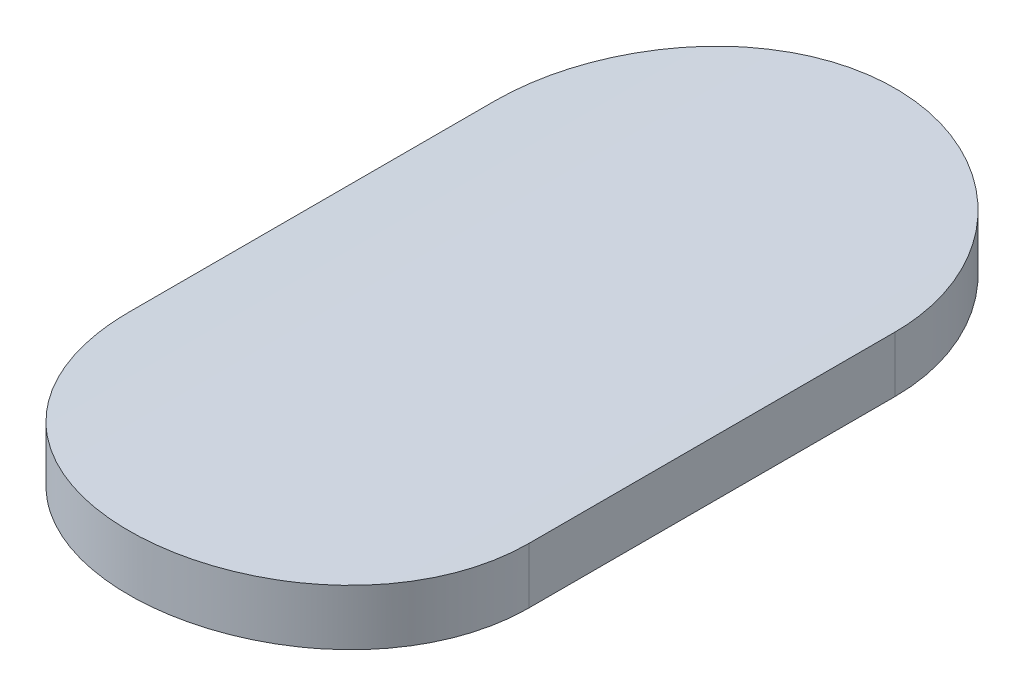
ISO-10303-21;
HEADER;
FILE_DESCRIPTION(('STEP AP214'),'2;1');
FILE_NAME('part.step','',(''),(''),'','','');
FILE_SCHEMA(('AUTOMOTIVE_DESIGN { 1 0 10303 214 1 1 1 1 }'));
ENDSEC;
DATA;
#1=APPLICATION_CONTEXT('core data for automotive mechanical design processes');
#2=APPLICATION_PROTOCOL_DEFINITION('international standard','automotive_design',2000,#1);
#3=PRODUCT_CONTEXT('',#1,'mechanical');
#4=PRODUCT('Part','Part','',(#3));
#5=PRODUCT_RELATED_PRODUCT_CATEGORY('part','',(#4));
#6=PRODUCT_DEFINITION_FORMATION('','',#4);
#7=PRODUCT_DEFINITION_CONTEXT('part definition',#1,'design');
#8=PRODUCT_DEFINITION('design','',#6,#7);
#9=PRODUCT_DEFINITION_SHAPE('','',#8);
#10=(LENGTH_UNIT() NAMED_UNIT(*) SI_UNIT(.MILLI.,.METRE.));
#11=(NAMED_UNIT(*) PLANE_ANGLE_UNIT() SI_UNIT($,.RADIAN.));
#12=(NAMED_UNIT(*) SI_UNIT($,.STERADIAN.) SOLID_ANGLE_UNIT());
#13=UNCERTAINTY_MEASURE_WITH_UNIT(LENGTH_MEASURE(1.E-05),#10,'distance_accuracy_value','');
#14=(GEOMETRIC_REPRESENTATION_CONTEXT(3) GLOBAL_UNCERTAINTY_ASSIGNED_CONTEXT((#13)) GLOBAL_UNIT_ASSIGNED_CONTEXT((#10,
#11,#12)) REPRESENTATION_CONTEXT('',''));
#15=CARTESIAN_POINT('',(0.,0.,0.));
#16=DIRECTION('',(0.,0.,1.));
#17=DIRECTION('',(1.,0.,0.));
#18=AXIS2_PLACEMENT_3D('',#15,#16,#17);
#19=CARTESIAN_POINT('',(-127.923352159799,-34.2539777719783,0.898559059800277));
#20=DIRECTION('',(0.,0.,1.));
#21=DIRECTION('',(1.,0.,0.));
#22=AXIS2_PLACEMENT_3D('',#19,#20,#21);
#23=CYLINDRICAL_SURFACE('',#22,4.);
#24=DIRECTION('',(0.,0.,1.));
#25=VECTOR('',#24,1.);
#26=CARTESIAN_POINT('',(-127.491108186985,-30.2774007077224,-0.678492229661472));
#27=LINE('',#26,#25);
#28=CARTESIAN_POINT('',(-127.491108186985,-30.2774007077224,-0.678492229661475));
#29=VERTEX_POINT('',#28);
#30=CARTESIAN_POINT('',(-127.491108186985,-30.2774007077224,-1.46918242298189));
#31=VERTEX_POINT('',#30);
#32=EDGE_CURVE('E72',#29,#31,#27,.F.);
#33=ORIENTED_EDGE('',*,*,#32,.T.);
#34=CARTESIAN_POINT('',(-128.355596132613,-30.2774007077224,-1.46918242298189));
#35=CARTESIAN_POINT('',(-128.355617122564,-30.2774093031019,-1.49342415054569));
#36=CARTESIAN_POINT('',(-128.353558088976,-30.2771792736355,-1.51765810390606));
#37=CARTESIAN_POINT('',(-128.34543664358,-30.2763057646066,-1.56541496661541));
#38=CARTESIAN_POINT('',(-128.339378115823,-30.275662686187,-1.58893854268275));
#39=CARTESIAN_POINT('',(-128.323410759997,-30.2740263383597,-1.6346374642423));
#40=CARTESIAN_POINT('',(-128.313500468394,-30.2730329358545,-1.65681229355003));
#41=CARTESIAN_POINT('',(-128.290122387864,-30.2708109602009,-1.69918125964866));
#42=CARTESIAN_POINT('',(-128.276655134346,-30.2695824224536,-1.71937569391019));
#43=CARTESIAN_POINT('',(-128.246485774422,-30.2670223239816,-1.75729478754694));
#44=CARTESIAN_POINT('',(-128.229772278111,-30.2656904107286,-1.77501036152479));
#45=CARTESIAN_POINT('',(-128.193602531438,-30.2630765062061,-1.80739683876146));
#46=CARTESIAN_POINT('',(-128.174145251963,-30.2617945338994,-1.8220665944957));
#47=CARTESIAN_POINT('',(-128.132979806713,-30.2594212030673,-1.8479758835284));
#48=CARTESIAN_POINT('',(-128.111265352569,-30.2583304011072,-1.85920546999589));
#49=CARTESIAN_POINT('',(-128.06626175851,-30.256468301793,-1.87784310001374));
#50=CARTESIAN_POINT('',(-128.042974493225,-30.2556966316195,-1.88525560529049));
#51=CARTESIAN_POINT('',(-128.003525585014,-30.2547502618519,-1.89423234228377));
#52=CARTESIAN_POINT('',(-127.98761455235,-30.2544619567996,-1.89692632382277));
#53=CARTESIAN_POINT('',(-127.955588715831,-30.2540756112707,-1.90052371061654));
#54=CARTESIAN_POINT('',(-127.939473908818,-30.2539775737453,-1.90142708809718));
#55=CARTESIAN_POINT('',(-127.899148198746,-30.2539780695901,-1.90142535642739));
#56=CARTESIAN_POINT('',(-127.874928590604,-30.2541997878823,-1.89938656879107));
#57=CARTESIAN_POINT('',(-127.827162093491,-30.2550629316294,-1.89128473995332));
#58=CARTESIAN_POINT('',(-127.803615946452,-30.2557048026716,-1.88521742625409));
#59=CARTESIAN_POINT('',(-127.75789437027,-30.2573358336208,-1.86923797188849));
#60=CARTESIAN_POINT('',(-127.735718096663,-30.2583247770098,-1.85932822788572));
#61=CARTESIAN_POINT('',(-127.693347746542,-30.260539573146,-1.83594976445063));
#62=CARTESIAN_POINT('',(-127.6731533329,-30.2617653854946,-1.82248165176367));
#63=CARTESIAN_POINT('',(-127.635232215171,-30.264322400245,-1.7923093292943));
#64=CARTESIAN_POINT('',(-127.617514873633,-30.2656539741725,-1.77559338359708));
#65=CARTESIAN_POINT('',(-127.585130542844,-30.2682694573901,-1.73942346959317));
#66=CARTESIAN_POINT('',(-127.570463816169,-30.2695533625694,-1.71996926583743));
#67=CARTESIAN_POINT('',(-127.544561149847,-30.2719321143963,-1.67881358279142));
#68=CARTESIAN_POINT('',(-127.533334696151,-30.2730264347539,-1.65710610696893));
#69=CARTESIAN_POINT('',(-127.514694899956,-30.2748965279095,-1.61210325687929));
#70=CARTESIAN_POINT('',(-127.507279455028,-30.275672476297,-1.58880876617574));
#71=CARTESIAN_POINT('',(-127.498299357738,-30.2766239966666,-1.54934191245782));
#72=CARTESIAN_POINT('',(-127.495604627655,-30.2769138194438,-1.53342024600917));
#73=CARTESIAN_POINT('',(-127.492009108139,-30.2773027678914,-1.50139550136583));
#74=CARTESIAN_POINT('',(-127.491105867911,-30.2774021540766,-1.48529270135609));
#75=CARTESIAN_POINT('',(-127.491108186985,-30.2774007077224,-1.46918242298189));
#76=B_SPLINE_CURVE_WITH_KNOTS('',3,(#34,#35,#36,#37,#38,#39,#40,#41,#42,#43,#44,#45,#46,#47,#48,
#49,#50,#51,#52,#53,#54,#55,#56,#57,#58,#59,#60,#61,#62,#63,#64,#65,#66,#67,#68,#69,#70,#71,#72,
#73,#74,#75),.UNSPECIFIED.,.F.,.F.,(4,2,2,2,2,2,2,2,2,2,2,2,2,2,2,2,2,2,2,2,4),(0.,
0.0726253836740618,0.145180341790964,0.217762895225312,0.29033452944683,0.363165547703872,
0.436023955754679,0.509091078909629,0.58207260007002,0.630397888655176,0.678723926810382,
0.751276944723526,0.823907032711242,0.896491891356269,0.969064381374195,1.04190415719805,
1.11475019997867,1.18779533226152,1.26080012417625,1.30915708875173,1.3574478542525),.UNSPECIFIED.);
#77=CARTESIAN_POINT('',(-128.355596132613,-30.2774007077224,-1.46918242298189));
#78=VERTEX_POINT('',#77);
#79=EDGE_CURVE('E21',#78,#31,#76,.T.);
#80=ORIENTED_EDGE('',*,*,#79,.F.);
#81=DIRECTION('',(0.,0.,1.));
#82=VECTOR('',#81,1.);
#83=CARTESIAN_POINT('',(-128.355596132613,-30.2774007077224,-1.46918242298189));
#84=LINE('',#83,#82);
#85=CARTESIAN_POINT('',(-128.355596132613,-30.2774007077224,-0.678492229661472));
#86=VERTEX_POINT('',#85);
#87=EDGE_CURVE('E59',#78,#86,#84,.T.);
#88=ORIENTED_EDGE('',*,*,#87,.T.);
#89=CARTESIAN_POINT('',(-127.491108186985,-30.2774007077224,-0.678492229661474));
#90=CARTESIAN_POINT('',(-127.491087200258,-30.2774093032284,-0.654250427458845));
#91=CARTESIAN_POINT('',(-127.493146244914,-30.2771792722828,-0.630016399645478));
#92=CARTESIAN_POINT('',(-127.501267711605,-30.2763057606253,-0.582259541124402));
#93=CARTESIAN_POINT('',(-127.507326225035,-30.2756626835922,-0.558736039480906));
#94=CARTESIAN_POINT('',(-127.523293392494,-30.2740263559012,-0.513037676301115));
#95=CARTESIAN_POINT('',(-127.533203439736,-30.2730329785416,-0.490863306145451));
#96=CARTESIAN_POINT('',(-127.556581342248,-30.2708110127296,-0.448494260139314));
#97=CARTESIAN_POINT('',(-127.570048813953,-30.269582449639,-0.428299371181569));
#98=CARTESIAN_POINT('',(-127.600220287064,-30.2670221805072,-0.390377730187715));
#99=CARTESIAN_POINT('',(-127.6169359698,-30.2656901129391,-0.372660295426246));
#100=CARTESIAN_POINT('',(-127.653105985133,-30.2630762167541,-0.340274534345393));
#101=CARTESIAN_POINT('',(-127.672560734073,-30.2617943958127,-0.325606672407616));
#102=CARTESIAN_POINT('',(-127.713713980875,-30.2594218523872,-0.299705735613899));
#103=CARTESIAN_POINT('',(-127.735417823731,-30.2583316025356,-0.288481106240474));
#104=CARTESIAN_POINT('',(-127.780414746846,-30.256469127083,-0.269839910920559));
#105=CARTESIAN_POINT('',(-127.803707686985,-30.2556968734842,-0.262423009712415));
#106=CARTESIAN_POINT('',(-127.851126252775,-30.2545598909362,-0.251634896140754));
#107=CARTESIAN_POINT('',(-127.875248269521,-30.2541935815582,-0.248247990307833));
#108=CARTESIAN_POINT('',(-127.923721524934,-30.2539043752213,-0.245567410692591));
#109=CARTESIAN_POINT('',(-127.948072762323,-30.2539814757901,-0.246273714087672));
#110=CARTESIAN_POINT('',(-127.996205292226,-30.2545691293883,-0.251746959967107));
#111=CARTESIAN_POINT('',(-128.019988542231,-30.2550778685343,-0.256496910034631));
#112=CARTESIAN_POINT('',(-128.066418176187,-30.2564695592699,-0.269896092472021));
#113=CARTESIAN_POINT('',(-128.089064549109,-30.2573525144896,-0.278545362667916));
#114=CARTESIAN_POINT('',(-128.132631413093,-30.2593965328097,-0.299516328549055));
#115=CARTESIAN_POINT('',(-128.153548245803,-30.2605581661113,-0.311845566586497));
#116=CARTESIAN_POINT('',(-128.193021297876,-30.2630292276311,-0.339820407305529));
#117=CARTESIAN_POINT('',(-128.211577539937,-30.2643386544279,-0.355465978094735));
#118=CARTESIAN_POINT('',(-128.245901026669,-30.266966287132,-0.38972256596268));
#119=CARTESIAN_POINT('',(-128.261653919007,-30.2682845042809,-0.408347965710109));
#120=CARTESIAN_POINT('',(-128.289816419944,-30.2707749518531,-0.447992642075992));
#121=CARTESIAN_POINT('',(-128.302225018855,-30.2719471381305,-0.469012638937776));
#122=CARTESIAN_POINT('',(-128.323347957904,-30.2740134538803,-0.51286780268918));
#123=CARTESIAN_POINT('',(-128.33205911907,-30.2749073439048,-0.535704511598378));
#124=CARTESIAN_POINT('',(-128.345502485206,-30.276310415507,-0.582500581006857));
#125=CARTESIAN_POINT('',(-128.350240700685,-30.276820178097,-0.606458187554224));
#126=CARTESIAN_POINT('',(-128.354711987777,-30.2773050457114,-0.646526456869655));
#127=CARTESIAN_POINT('',(-128.355603730248,-30.2774034970038,-0.662513193898366));
#128=CARTESIAN_POINT('',(-128.355596132613,-30.2774007077224,-0.678492229661471));
#129=B_SPLINE_CURVE_WITH_KNOTS('',3,(#89,#90,#91,#92,#93,#94,#95,#96,#97,#98,#99,#100,#101,#102,
#103,#104,#105,#106,#107,#108,#109,#110,#111,#112,#113,#114,#115,#116,#117,#118,#119,#120,#121,
#122,#123,#124,#125,#126,#127,#128),.UNSPECIFIED.,.F.,.F.,(4,2,2,2,2,2,2,2,2,2,2,2,2,2,2,2,2,2,
2,4),(0.,0.072625606291323,0.145180341787483,0.217761346895158,0.290334529464339,
0.363173700807065,0.436023955812664,0.509051493289564,0.582072599757541,0.654808409475985,
0.72754381364014,0.799975065682706,0.872407020372288,0.944988460927709,1.01756920351632,
1.09051146956909,1.1634757333035,1.23650260356937,1.30941879404999,1.35735159725356),.UNSPECIFIED.);
#130=EDGE_CURVE('E73',#29,#86,#129,.T.);
#131=ORIENTED_EDGE('',*,*,#130,.F.);
#132=EDGE_LOOP('',(#33,#80,#88,#131));
#133=FACE_BOUND('',#132,.T.);
#134=ADVANCED_FACE('F17',(#133),#23,.T.);
#135=CARTESIAN_POINT('',(-127.491108186985,-36.1825523620957,-0.678492229661472));
#136=DIRECTION('',(-1.,0.,0.));
#137=DIRECTION('',(0.,0.,1.));
#138=AXIS2_PLACEMENT_3D('',#135,#136,#137);
#139=PLANE('',#138);
#140=DIRECTION('',(0.,0.,1.));
#141=VECTOR('',#140,1.);
#142=CARTESIAN_POINT('',(-127.491108186985,-30.3981295970671,0.898559059800277));
#143=LINE('',#142,#141);
#144=CARTESIAN_POINT('',(-127.491108186985,-30.3981295970671,-0.678492229661472));
#145=VERTEX_POINT('',#144);
#146=CARTESIAN_POINT('',(-127.491108186985,-30.3981295970671,-1.46918242298189));
#147=VERTEX_POINT('',#146);
#148=EDGE_CURVE('E80',#145,#147,#143,.F.);
#149=ORIENTED_EDGE('',*,*,#148,.T.);
#150=DIRECTION('',(0.,-1.,0.));
#151=VECTOR('',#150,1.);
#152=CARTESIAN_POINT('',(-127.491108186985,-36.1825523620957,-1.46918242298189));
#153=LINE('',#152,#151);
#154=EDGE_CURVE('E67',#31,#147,#153,.T.);
#155=ORIENTED_EDGE('',*,*,#154,.F.);
#156=ORIENTED_EDGE('',*,*,#32,.F.);
#157=DIRECTION('',(0.,-1.,0.));
#158=VECTOR('',#157,1.);
#159=CARTESIAN_POINT('',(-127.491108186985,-36.1825523620957,-0.678492229661473));
#160=LINE('',#159,#158);
#161=EDGE_CURVE('E106',#145,#29,#160,.F.);
#162=ORIENTED_EDGE('',*,*,#161,.F.);
#163=EDGE_LOOP('',(#149,#155,#156,#162));
#164=FACE_BOUND('',#163,.T.);
#165=ADVANCED_FACE('F79',(#164),#139,.F.);
#166=CARTESIAN_POINT('',(-127.923352159799,-36.1825523620957,-1.46918242298189));
#167=DIRECTION('',(0.,-1.,0.));
#168=DIRECTION('',(0.,0.,-1.));
#169=AXIS2_PLACEMENT_3D('',#166,#167,#168);
#170=CYLINDRICAL_SURFACE('',#169,0.432243972813884);
#171=CARTESIAN_POINT('',(-127.491108186985,-30.3981295970671,-1.46918242298189));
#172=CARTESIAN_POINT('',(-127.491087176005,-30.3981384613911,-1.49341944056628));
#173=CARTESIAN_POINT('',(-127.493145434531,-30.3979013183327,-1.51764858241784));
#174=CARTESIAN_POINT('',(-127.50126353888,-30.3970008343414,-1.56539543040902));
#175=CARTESIAN_POINT('',(-127.507319440707,-30.3963379134897,-1.5889138138771));
#176=CARTESIAN_POINT('',(-127.523279427615,-30.3946511351842,-1.63460239824323));
#177=CARTESIAN_POINT('',(-127.533184950578,-30.3936271428788,-1.65677209180602));
#178=CARTESIAN_POINT('',(-127.556551387832,-30.3913367859818,-1.69913183460088));
#179=CARTESIAN_POINT('',(-127.570011787124,-30.390070456505,-1.7193221700041));
#180=CARTESIAN_POINT('',(-127.600169143537,-30.3874312779715,-1.75723922149469));
#181=CARTESIAN_POINT('',(-127.616878216478,-30.3860580420779,-1.77495627487206));
#182=CARTESIAN_POINT('',(-127.653039344167,-30.3833629484715,-1.80734680014699));
#183=CARTESIAN_POINT('',(-127.672492427153,-30.3820411102565,-1.822019126007));
#184=CARTESIAN_POINT('',(-127.713653639597,-30.3795936233061,-1.84793680148068));
#185=CARTESIAN_POINT('',(-127.735368406291,-30.3784685795403,-1.85917166054735));
#186=CARTESIAN_POINT('',(-127.780374427183,-30.3765478765735,-1.87781944664759));
#187=CARTESIAN_POINT('',(-127.803663803901,-30.3757518328769,-1.88523683757819));
#188=CARTESIAN_POINT('',(-127.843125385669,-30.3747752200699,-1.89422267943798));
#189=CARTESIAN_POINT('',(-127.859046755777,-30.3744776019595,-1.89692026775505));
#190=CARTESIAN_POINT('',(-127.891093821193,-30.3740787743024,-1.90052248605247));
#191=CARTESIAN_POINT('',(-127.907219519592,-30.3739775677314,-1.90142708886888));
#192=CARTESIAN_POINT('',(-127.947551264425,-30.3739780783505,-1.90142535617991));
#193=CARTESIAN_POINT('',(-127.971765988302,-30.3742065617847,-1.89938737651733));
#194=CARTESIAN_POINT('',(-128.019522627822,-30.3750960459599,-1.89128890974642));
#195=CARTESIAN_POINT('',(-128.043063802579,-30.3757575052113,-1.88522415829136));
#196=CARTESIAN_POINT('',(-128.088775364138,-30.3774383313766,-1.86925191024036));
#197=CARTESIAN_POINT('',(-128.110946610709,-30.37845747107,-1.85934685282353));
#198=CARTESIAN_POINT('',(-128.153307852799,-30.3807399867703,-1.83597987159557));
#199=CARTESIAN_POINT('',(-128.17349818065,-30.3820033217033,-1.82251854581362));
#200=CARTESIAN_POINT('',(-128.211417161898,-30.3846390968794,-1.7923581712782));
#201=CARTESIAN_POINT('',(-128.2291358879,-30.386011944167,-1.77564667651009));
#202=CARTESIAN_POINT('',(-128.261524100921,-30.3887087594235,-1.73948545719076));
#203=CARTESIAN_POINT('',(-128.27619332337,-30.3900327231431,-1.72003549530107));
#204=CARTESIAN_POINT('',(-128.302104305741,-30.3924861836675,-1.67888406369999));
#205=CARTESIAN_POINT('',(-128.313336019618,-30.39361510636,-1.65717623851951));
#206=CARTESIAN_POINT('',(-128.331985926315,-30.3955445537706,-1.61217092701875));
#207=CARTESIAN_POINT('',(-128.339406230906,-30.3963452602922,-1.58887432910599));
#208=CARTESIAN_POINT('',(-128.348395355563,-30.3973275070232,-1.54939493445787));
#209=CARTESIAN_POINT('',(-128.351093656768,-30.3976267939651,-1.53346306573968));
#210=CARTESIAN_POINT('',(-128.354693994571,-30.3980284543278,-1.50141725400007));
#211=CARTESIAN_POINT('',(-128.355598470814,-30.3981310951857,-1.48530358828352));
#212=CARTESIAN_POINT('',(-128.355596132613,-30.3981295970671,-1.46918242298189));
#213=B_SPLINE_CURVE_WITH_KNOTS('',3,(#171,#172,#173,#174,#175,#176,#177,#178,#179,#180,#181,
#182,#183,#184,#185,#186,#187,#188,#189,#190,#191,#192,#193,#194,#195,#196,#197,#198,#199,#200,
#201,#202,#203,#204,#205,#206,#207,#208,#209,#210,#211,#212),.UNSPECIFIED.,.F.,.F.,(4,2,2,2,2,2,
2,2,2,2,2,2,2,2,2,2,2,2,2,2,4),(0.,0.0726110703568825,0.145150610932121,0.217717272017475,
0.290273426057522,0.363105554309546,0.435965047098417,0.509044726041053,0.582038755124304,
0.630396664646984,0.678755306791643,0.751293702605126,0.82390903928089,0.89647832951797,
0.969035424117948,1.04187603897329,1.1147229706965,1.18778080670378,1.26079812010336,
1.30918729504396,1.35751061429023),.UNSPECIFIED.);
#214=CARTESIAN_POINT('',(-128.355596132613,-30.3981295970671,-1.46918242298189));
#215=VERTEX_POINT('',#214);
#216=EDGE_CURVE('E91',#147,#215,#213,.T.);
#217=ORIENTED_EDGE('',*,*,#216,.T.);
#218=DIRECTION('',(0.,1.,0.));
#219=VECTOR('',#218,1.);
#220=CARTESIAN_POINT('',(-128.355596132613,-36.1825523620957,-1.46918242298189));
#221=LINE('',#220,#219);
#222=EDGE_CURVE('E69',#215,#78,#221,.T.);
#223=ORIENTED_EDGE('',*,*,#222,.T.);
#224=ORIENTED_EDGE('',*,*,#79,.T.);
#225=ORIENTED_EDGE('',*,*,#154,.T.);
#226=EDGE_LOOP('',(#217,#223,#224,#225));
#227=FACE_BOUND('',#226,.T.);
#228=ADVANCED_FACE('F65',(#227),#170,.T.);
#229=CARTESIAN_POINT('',(-128.355596132613,-36.1825523620957,-1.46918242298189));
#230=DIRECTION('',(1.,0.,0.));
#231=DIRECTION('',(0.,1.,0.));
#232=AXIS2_PLACEMENT_3D('',#229,#230,#231);
#233=PLANE('',#232);
#234=DIRECTION('',(0.,0.,1.));
#235=VECTOR('',#234,1.);
#236=CARTESIAN_POINT('',(-128.355596132613,-30.3981295970671,0.898559059800277));
#237=LINE('',#236,#235);
#238=CARTESIAN_POINT('',(-128.355596132613,-30.3981295970671,-0.678492229661472));
#239=VERTEX_POINT('',#238);
#240=EDGE_CURVE('E31',#215,#239,#237,.T.);
#241=ORIENTED_EDGE('',*,*,#240,.T.);
#242=DIRECTION('',(0.,-1.,0.));
#243=VECTOR('',#242,1.);
#244=CARTESIAN_POINT('',(-128.355596132613,-36.1825523620957,-0.678492229661473));
#245=LINE('',#244,#243);
#246=EDGE_CURVE('E39',#86,#239,#245,.T.);
#247=ORIENTED_EDGE('',*,*,#246,.F.);
#248=ORIENTED_EDGE('',*,*,#87,.F.);
#249=ORIENTED_EDGE('',*,*,#222,.F.);
#250=EDGE_LOOP('',(#241,#247,#248,#249));
#251=FACE_BOUND('',#250,.T.);
#252=ADVANCED_FACE('F101',(#251),#233,.F.);
#253=CARTESIAN_POINT('',(-127.923352159799,-36.1825523620957,-0.678492229661472));
#254=DIRECTION('',(0.,-1.,0.));
#255=DIRECTION('',(0.,0.,-1.));
#256=AXIS2_PLACEMENT_3D('',#253,#254,#255);
#257=CYLINDRICAL_SURFACE('',#256,0.43224397281389);
#258=ORIENTED_EDGE('',*,*,#246,.T.);
#259=CARTESIAN_POINT('',(-128.355596132613,-30.3981295970671,-0.678492229661472));
#260=CARTESIAN_POINT('',(-128.355617140371,-30.3981384615207,-0.654255138314363));
#261=CARTESIAN_POINT('',(-128.353558870927,-30.3979013169546,-0.630025922883015));
#262=CARTESIAN_POINT('',(-128.345440745574,-30.3970008302842,-0.582279079030989));
#263=CARTESIAN_POINT('',(-128.339384857923,-30.3963379108451,-0.558760769112898));
#264=CARTESIAN_POINT('',(-128.323425058573,-30.3946511532194,-0.513072740926457));
#265=CARTESIAN_POINT('',(-128.313519779202,-30.3936271867664,-0.490903505220326));
#266=CARTESIAN_POINT('',(-128.290153519454,-30.3913368399867,-0.448543682770265));
#267=CARTESIAN_POINT('',(-128.276692902714,-30.390070484455,-0.428352893961435));
#268=CARTESIAN_POINT('',(-128.24653343749,-30.3874311302913,-0.390433299625361));
#269=CARTESIAN_POINT('',(-128.229822182128,-30.3860577355525,-0.372714388312746));
#270=CARTESIAN_POINT('',(-128.193660786458,-30.3833626505135,-0.340324577806701));
#271=CARTESIAN_POINT('',(-128.174210229727,-30.3820409681134,-0.325654142877604));
#272=CARTESIAN_POINT('',(-128.133061201093,-30.379594292289,-0.299744813580064));
#273=CARTESIAN_POINT('',(-128.111357034986,-30.3784698173995,-0.288514909526329));
#274=CARTESIAN_POINT('',(-128.066357682618,-30.3765487271556,-0.269863561490581));
#275=CARTESIAN_POINT('',(-128.043062639067,-30.3757520824379,-0.262441776406006));
#276=CARTESIAN_POINT('',(-127.995644198458,-30.3745791444223,-0.251646217455929));
#277=CARTESIAN_POINT('',(-127.971524641818,-30.3742011197578,-0.24825576611147));
#278=CARTESIAN_POINT('',(-127.923055516728,-30.3739021121989,-0.245567461354318));
#279=CARTESIAN_POINT('',(-127.898705949971,-30.373981125943,-0.246269577841495));
#280=CARTESIAN_POINT('',(-127.850582638488,-30.3745858992713,-0.251733161785291));
#281=CARTESIAN_POINT('',(-127.826806815965,-30.3751096722969,-0.256476578713643));
#282=CARTESIAN_POINT('',(-127.780390950882,-30.3765428469413,-0.269859929112584));
#283=CARTESIAN_POINT('',(-127.757750920178,-30.377452252585,-0.278499903253092));
#284=CARTESIAN_POINT('',(-127.71419228989,-30.3795579222314,-0.29945084576547));
#285=CARTESIAN_POINT('',(-127.693277561843,-30.3807548090076,-0.311769798244931));
#286=CARTESIAN_POINT('',(-127.653806526194,-30.3833012247143,-0.339722611264318));
#287=CARTESIAN_POINT('',(-127.635250201735,-30.3846507525537,-0.35535644810744));
#288=CARTESIAN_POINT('',(-127.600918114686,-30.3873597422384,-0.389594340997998));
#289=CARTESIAN_POINT('',(-127.585157616252,-30.3887192188171,-0.408213705639227));
#290=CARTESIAN_POINT('',(-127.55697882666,-30.3912880781798,-0.447848089734766));
#291=CARTESIAN_POINT('',(-127.544561541805,-30.3924974157133,-0.468863827790526));
#292=CARTESIAN_POINT('',(-127.523420239153,-30.3946297265931,-0.512713363280771));
#293=CARTESIAN_POINT('',(-127.514699494701,-30.3955524459422,-0.535548750877958));
#294=CARTESIAN_POINT('',(-127.501237187884,-30.3970012852222,-0.582344623757299));
#295=CARTESIAN_POINT('',(-127.496489618272,-30.3975280037641,-0.606303352465446));
#296=CARTESIAN_POINT('',(-127.491998016267,-30.3980303038749,-0.646423970544521));
#297=CARTESIAN_POINT('',(-127.491100513304,-30.3981325015031,-0.662461937081621));
#298=CARTESIAN_POINT('',(-127.491108186985,-30.3981295970671,-0.678492229661473));
#299=B_SPLINE_CURVE_WITH_KNOTS('',3,(#259,#260,#261,#262,#263,#264,#265,#266,#267,#268,#269,
#270,#271,#272,#273,#274,#275,#276,#277,#278,#279,#280,#281,#282,#283,#284,#285,#286,#287,#288,
#289,#290,#291,#292,#293,#294,#295,#296,#297,#298),.UNSPECIFIED.,.F.,.F.,(4,2,2,2,2,2,2,2,2,2,2,
2,2,2,2,2,2,2,2,4),(0.,0.0726112903627201,0.145150610928534,0.217715728023078,0.290273426076026,
0.363113694111983,0.435965047158869,0.509005172732491,0.582038754780198,0.654769136547269,
0.727498983395611,0.799905674146983,0.87231312065331,0.944878861818139,1.01744408425655,
1.0903940469234,1.16336594294014,1.23640232239223,1.30932807382706,1.35741434342201),.UNSPECIFIED.);
#300=EDGE_CURVE('E11',#239,#145,#299,.T.);
#301=ORIENTED_EDGE('',*,*,#300,.T.);
#302=ORIENTED_EDGE('',*,*,#161,.T.);
#303=ORIENTED_EDGE('',*,*,#130,.T.);
#304=EDGE_LOOP('',(#258,#301,#302,#303));
#305=FACE_BOUND('',#304,.T.);
#306=ADVANCED_FACE('F97',(#305),#257,.T.);
#307=CARTESIAN_POINT('',(-127.923352159799,-34.2539777719783,0.898559059800277));
#308=DIRECTION('',(0.,0.,1.));
#309=DIRECTION('',(1.,0.,0.));
#310=AXIS2_PLACEMENT_3D('',#307,#308,#309);
#311=CYLINDRICAL_SURFACE('',#310,3.87999999999999);
#312=ORIENTED_EDGE('',*,*,#240,.F.);
#313=ORIENTED_EDGE('',*,*,#216,.F.);
#314=ORIENTED_EDGE('',*,*,#148,.F.);
#315=ORIENTED_EDGE('',*,*,#300,.F.);
#316=EDGE_LOOP('',(#312,#313,#314,#315));
#317=FACE_BOUND('',#316,.T.);
#318=ADVANCED_FACE('F95',(#317),#311,.F.);
#319=CLOSED_SHELL('',(#134,#165,#228,#252,#306,#318));
#320=MANIFOLD_SOLID_BREP('B1',#319);
#321=ADVANCED_BREP_SHAPE_REPRESENTATION('',(#18,#320),#14);
#322=SHAPE_DEFINITION_REPRESENTATION(#9,#321);
ENDSEC;
END-ISO-10303-21;
